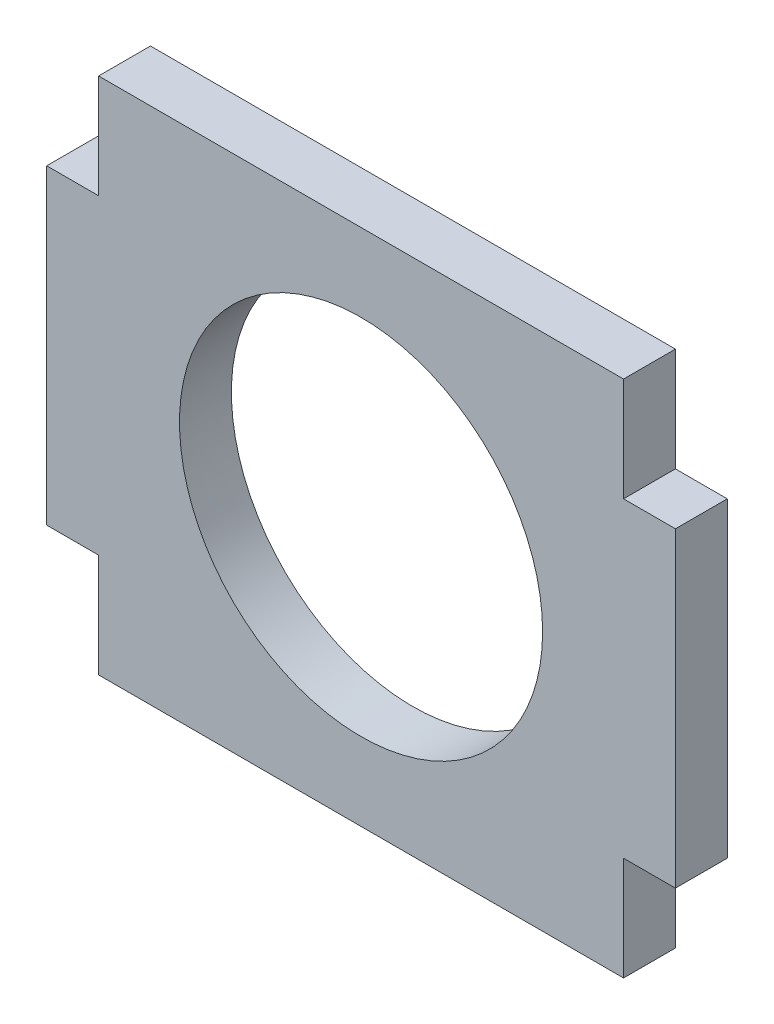
ISO-10303-21;
HEADER;
FILE_DESCRIPTION(('STEP AP214'),'2;1');
FILE_NAME('part.step','',(''),(''),'','','');
FILE_SCHEMA(('AUTOMOTIVE_DESIGN { 1 0 10303 214 1 1 1 1 }'));
ENDSEC;
DATA;
#1=APPLICATION_CONTEXT('core data for automotive mechanical design processes');
#2=APPLICATION_PROTOCOL_DEFINITION('international standard','automotive_design',2000,#1);
#3=PRODUCT_CONTEXT('',#1,'mechanical');
#4=PRODUCT('Part','Part','',(#3));
#5=PRODUCT_RELATED_PRODUCT_CATEGORY('part','',(#4));
#6=PRODUCT_DEFINITION_FORMATION('','',#4);
#7=PRODUCT_DEFINITION_CONTEXT('part definition',#1,'design');
#8=PRODUCT_DEFINITION('design','',#6,#7);
#9=PRODUCT_DEFINITION_SHAPE('','',#8);
#10=(LENGTH_UNIT() NAMED_UNIT(*) SI_UNIT(.MILLI.,.METRE.));
#11=(NAMED_UNIT(*) PLANE_ANGLE_UNIT() SI_UNIT($,.RADIAN.));
#12=(NAMED_UNIT(*) SI_UNIT($,.STERADIAN.) SOLID_ANGLE_UNIT());
#13=UNCERTAINTY_MEASURE_WITH_UNIT(LENGTH_MEASURE(1.E-05),#10,'distance_accuracy_value','');
#14=(GEOMETRIC_REPRESENTATION_CONTEXT(3) GLOBAL_UNCERTAINTY_ASSIGNED_CONTEXT((#13)) GLOBAL_UNIT_ASSIGNED_CONTEXT((#10,
#11,#12)) REPRESENTATION_CONTEXT('',''));
#15=CARTESIAN_POINT('',(0.,0.,0.));
#16=DIRECTION('',(0.,0.,1.));
#17=DIRECTION('',(1.,0.,0.));
#18=AXIS2_PLACEMENT_3D('',#15,#16,#17);
#19=CARTESIAN_POINT('',(0.,0.,3.175));
#20=DIRECTION('',(0.,0.,-1.));
#21=DIRECTION('',(-1.,0.,0.));
#22=AXIS2_PLACEMENT_3D('',#19,#20,#21);
#23=PLANE('',#22);
#24=DIRECTION('',(-1.,0.,0.));
#25=VECTOR('',#24,1.);
#26=CARTESIAN_POINT('',(-16.0655,9.525,3.175));
#27=LINE('',#26,#25);
#28=CARTESIAN_POINT('',(-16.0655,9.525,3.175));
#29=VERTEX_POINT('',#28);
#30=CARTESIAN_POINT('',(-19.2405,9.525,3.175));
#31=VERTEX_POINT('',#30);
#32=EDGE_CURVE('E182',#29,#31,#27,.T.);
#33=ORIENTED_EDGE('',*,*,#32,.T.);
#34=DIRECTION('',(0.,-1.,0.));
#35=VECTOR('',#34,1.);
#36=CARTESIAN_POINT('',(-19.2405,-9.525,3.175));
#37=LINE('',#36,#35);
#38=CARTESIAN_POINT('',(-19.2405,-9.525,3.175));
#39=VERTEX_POINT('',#38);
#40=EDGE_CURVE('E110',#31,#39,#37,.T.);
#41=ORIENTED_EDGE('',*,*,#40,.T.);
#42=DIRECTION('',(1.,0.,0.));
#43=VECTOR('',#42,1.);
#44=CARTESIAN_POINT('',(-19.2405,-9.525,3.175));
#45=LINE('',#44,#43);
#46=CARTESIAN_POINT('',(-16.0655,-9.525,3.175));
#47=VERTEX_POINT('',#46);
#48=EDGE_CURVE('E209',#39,#47,#45,.T.);
#49=ORIENTED_EDGE('',*,*,#48,.T.);
#50=DIRECTION('',(0.,-1.,0.));
#51=VECTOR('',#50,1.);
#52=CARTESIAN_POINT('',(-16.0655,-9.525,3.175));
#53=LINE('',#52,#51);
#54=CARTESIAN_POINT('',(-16.0655,-15.875,3.175));
#55=VERTEX_POINT('',#54);
#56=EDGE_CURVE('E228',#47,#55,#53,.T.);
#57=ORIENTED_EDGE('',*,*,#56,.T.);
#58=DIRECTION('',(1.,0.,0.));
#59=VECTOR('',#58,1.);
#60=CARTESIAN_POINT('',(-16.0655,-15.875,3.175));
#61=LINE('',#60,#59);
#62=CARTESIAN_POINT('',(16.0655,-15.875,3.175));
#63=VERTEX_POINT('',#62);
#64=EDGE_CURVE('E225',#55,#63,#61,.T.);
#65=ORIENTED_EDGE('',*,*,#64,.T.);
#66=DIRECTION('',(0.,1.,0.));
#67=VECTOR('',#66,1.);
#68=CARTESIAN_POINT('',(16.0655,-15.875,3.175));
#69=LINE('',#68,#67);
#70=CARTESIAN_POINT('',(16.0655,-9.525,3.175));
#71=VERTEX_POINT('',#70);
#72=EDGE_CURVE('E227',#63,#71,#69,.T.);
#73=ORIENTED_EDGE('',*,*,#72,.T.);
#74=DIRECTION('',(1.,0.,0.));
#75=VECTOR('',#74,1.);
#76=CARTESIAN_POINT('',(16.0655,-9.525,3.175));
#77=LINE('',#76,#75);
#78=CARTESIAN_POINT('',(19.2405,-9.525,3.175));
#79=VERTEX_POINT('',#78);
#80=EDGE_CURVE('E230',#71,#79,#77,.T.);
#81=ORIENTED_EDGE('',*,*,#80,.T.);
#82=DIRECTION('',(0.,1.,0.));
#83=VECTOR('',#82,1.);
#84=CARTESIAN_POINT('',(19.2405,-9.525,3.175));
#85=LINE('',#84,#83);
#86=CARTESIAN_POINT('',(19.2405,9.525,3.175));
#87=VERTEX_POINT('',#86);
#88=EDGE_CURVE('E236',#79,#87,#85,.T.);
#89=ORIENTED_EDGE('',*,*,#88,.T.);
#90=DIRECTION('',(-1.,0.,0.));
#91=VECTOR('',#90,1.);
#92=CARTESIAN_POINT('',(19.2405,9.525,3.175));
#93=LINE('',#92,#91);
#94=CARTESIAN_POINT('',(16.0655,9.525,3.175));
#95=VERTEX_POINT('',#94);
#96=EDGE_CURVE('E141',#87,#95,#93,.T.);
#97=ORIENTED_EDGE('',*,*,#96,.T.);
#98=DIRECTION('',(0.,1.,0.));
#99=VECTOR('',#98,1.);
#100=CARTESIAN_POINT('',(16.0655,9.525,3.175));
#101=LINE('',#100,#99);
#102=CARTESIAN_POINT('',(16.0655,15.875,3.175));
#103=VERTEX_POINT('',#102);
#104=EDGE_CURVE('E135',#95,#103,#101,.T.);
#105=ORIENTED_EDGE('',*,*,#104,.T.);
#106=DIRECTION('',(-1.,0.,0.));
#107=VECTOR('',#106,1.);
#108=CARTESIAN_POINT('',(16.0655,15.875,3.175));
#109=LINE('',#108,#107);
#110=CARTESIAN_POINT('',(-16.0655,15.875,3.175));
#111=VERTEX_POINT('',#110);
#112=EDGE_CURVE('E139',#103,#111,#109,.T.);
#113=ORIENTED_EDGE('',*,*,#112,.T.);
#114=DIRECTION('',(0.,-1.,0.));
#115=VECTOR('',#114,1.);
#116=CARTESIAN_POINT('',(-16.0655,15.875,3.175));
#117=LINE('',#116,#115);
#118=EDGE_CURVE('E55',#111,#29,#117,.T.);
#119=ORIENTED_EDGE('',*,*,#118,.T.);
#120=EDGE_LOOP('',(#33,#41,#49,#57,#65,#73,#81,#89,#97,#105,#113,#119));
#121=FACE_BOUND('',#120,.T.);
#122=CARTESIAN_POINT('',(0.,0.,3.175));
#123=DIRECTION('',(0.,0.,1.));
#124=DIRECTION('',(1.,0.,0.));
#125=AXIS2_PLACEMENT_3D('',#122,#123,#124);
#126=CIRCLE('',#125,11.1125);
#127=CARTESIAN_POINT('',(11.1125,0.,3.175));
#128=VERTEX_POINT('',#127);
#129=EDGE_CURVE('E163',#128,#128,#126,.T.);
#130=ORIENTED_EDGE('',*,*,#129,.F.);
#131=EDGE_LOOP('',(#130));
#132=FACE_BOUND('',#131,.T.);
#133=ADVANCED_FACE('F38',(#121,#132),#23,.F.);
#134=CARTESIAN_POINT('',(0.,0.,0.));
#135=DIRECTION('',(0.,0.,-1.));
#136=DIRECTION('',(-1.,0.,0.));
#137=AXIS2_PLACEMENT_3D('',#134,#135,#136);
#138=PLANE('',#137);
#139=DIRECTION('',(-1.,0.,0.));
#140=VECTOR('',#139,1.);
#141=CARTESIAN_POINT('',(-16.0655,9.525,0.));
#142=LINE('',#141,#140);
#143=CARTESIAN_POINT('',(-16.0655,9.525,0.));
#144=VERTEX_POINT('',#143);
#145=CARTESIAN_POINT('',(-19.2405,9.525,0.));
#146=VERTEX_POINT('',#145);
#147=EDGE_CURVE('E159',#144,#146,#142,.T.);
#148=ORIENTED_EDGE('',*,*,#147,.F.);
#149=DIRECTION('',(0.,-1.,0.));
#150=VECTOR('',#149,1.);
#151=CARTESIAN_POINT('',(-16.0655,15.875,0.));
#152=LINE('',#151,#150);
#153=CARTESIAN_POINT('',(-16.0655,15.875,0.));
#154=VERTEX_POINT('',#153);
#155=EDGE_CURVE('E102',#154,#144,#152,.T.);
#156=ORIENTED_EDGE('',*,*,#155,.F.);
#157=DIRECTION('',(-1.,0.,0.));
#158=VECTOR('',#157,1.);
#159=CARTESIAN_POINT('',(16.0655,15.875,0.));
#160=LINE('',#159,#158);
#161=CARTESIAN_POINT('',(16.0655,15.875,0.));
#162=VERTEX_POINT('',#161);
#163=EDGE_CURVE('E96',#162,#154,#160,.T.);
#164=ORIENTED_EDGE('',*,*,#163,.F.);
#165=DIRECTION('',(0.,1.,0.));
#166=VECTOR('',#165,1.);
#167=CARTESIAN_POINT('',(16.0655,9.525,0.));
#168=LINE('',#167,#166);
#169=CARTESIAN_POINT('',(16.0655,9.525,0.));
#170=VERTEX_POINT('',#169);
#171=EDGE_CURVE('E149',#170,#162,#168,.T.);
#172=ORIENTED_EDGE('',*,*,#171,.F.);
#173=DIRECTION('',(-1.,0.,0.));
#174=VECTOR('',#173,1.);
#175=CARTESIAN_POINT('',(19.2405,9.525,0.));
#176=LINE('',#175,#174);
#177=CARTESIAN_POINT('',(19.2405,9.525,0.));
#178=VERTEX_POINT('',#177);
#179=EDGE_CURVE('E177',#178,#170,#176,.T.);
#180=ORIENTED_EDGE('',*,*,#179,.F.);
#181=DIRECTION('',(0.,1.,0.));
#182=VECTOR('',#181,1.);
#183=CARTESIAN_POINT('',(19.2405,-9.525,0.));
#184=LINE('',#183,#182);
#185=CARTESIAN_POINT('',(19.2405,-9.525,0.));
#186=VERTEX_POINT('',#185);
#187=EDGE_CURVE('E175',#186,#178,#184,.T.);
#188=ORIENTED_EDGE('',*,*,#187,.F.);
#189=DIRECTION('',(1.,0.,0.));
#190=VECTOR('',#189,1.);
#191=CARTESIAN_POINT('',(16.0655,-9.525,0.));
#192=LINE('',#191,#190);
#193=CARTESIAN_POINT('',(16.0655,-9.525,0.));
#194=VERTEX_POINT('',#193);
#195=EDGE_CURVE('E173',#194,#186,#192,.T.);
#196=ORIENTED_EDGE('',*,*,#195,.F.);
#197=DIRECTION('',(0.,1.,0.));
#198=VECTOR('',#197,1.);
#199=CARTESIAN_POINT('',(16.0655,-15.875,0.));
#200=LINE('',#199,#198);
#201=CARTESIAN_POINT('',(16.0655,-15.875,0.));
#202=VERTEX_POINT('',#201);
#203=EDGE_CURVE('E171',#202,#194,#200,.T.);
#204=ORIENTED_EDGE('',*,*,#203,.F.);
#205=DIRECTION('',(1.,0.,0.));
#206=VECTOR('',#205,1.);
#207=CARTESIAN_POINT('',(-16.0655,-15.875,0.));
#208=LINE('',#207,#206);
#209=CARTESIAN_POINT('',(-16.0655,-15.875,0.));
#210=VERTEX_POINT('',#209);
#211=EDGE_CURVE('E169',#210,#202,#208,.T.);
#212=ORIENTED_EDGE('',*,*,#211,.F.);
#213=DIRECTION('',(0.,-1.,0.));
#214=VECTOR('',#213,1.);
#215=CARTESIAN_POINT('',(-16.0655,-9.525,0.));
#216=LINE('',#215,#214);
#217=CARTESIAN_POINT('',(-16.0655,-9.525,0.));
#218=VERTEX_POINT('',#217);
#219=EDGE_CURVE('E167',#218,#210,#216,.T.);
#220=ORIENTED_EDGE('',*,*,#219,.F.);
#221=DIRECTION('',(1.,0.,0.));
#222=VECTOR('',#221,1.);
#223=CARTESIAN_POINT('',(-19.2405,-9.525,0.));
#224=LINE('',#223,#222);
#225=CARTESIAN_POINT('',(-19.2405,-9.525,0.));
#226=VERTEX_POINT('',#225);
#227=EDGE_CURVE('E165',#226,#218,#224,.T.);
#228=ORIENTED_EDGE('',*,*,#227,.F.);
#229=DIRECTION('',(0.,-1.,0.));
#230=VECTOR('',#229,1.);
#231=CARTESIAN_POINT('',(-19.2405,-9.525,0.));
#232=LINE('',#231,#230);
#233=EDGE_CURVE('E162',#146,#226,#232,.T.);
#234=ORIENTED_EDGE('',*,*,#233,.F.);
#235=EDGE_LOOP('',(#148,#156,#164,#172,#180,#188,#196,#204,#212,#220,#228,#234));
#236=FACE_BOUND('',#235,.T.);
#237=CARTESIAN_POINT('',(0.,0.,0.));
#238=DIRECTION('',(0.,0.,1.));
#239=DIRECTION('',(1.,0.,0.));
#240=AXIS2_PLACEMENT_3D('',#237,#238,#239);
#241=CIRCLE('',#240,11.1125);
#242=CARTESIAN_POINT('',(11.1125,0.,0.));
#243=VERTEX_POINT('',#242);
#244=EDGE_CURVE('E383',#243,#243,#241,.T.);
#245=ORIENTED_EDGE('',*,*,#244,.T.);
#246=EDGE_LOOP('',(#245));
#247=FACE_BOUND('',#246,.T.);
#248=ADVANCED_FACE('F213',(#236,#247),#138,.T.);
#249=CARTESIAN_POINT('',(-16.0655,9.525,3.175));
#250=DIRECTION('',(0.,-1.,0.));
#251=DIRECTION('',(0.,0.,-1.));
#252=AXIS2_PLACEMENT_3D('',#249,#250,#251);
#253=PLANE('',#252);
#254=ORIENTED_EDGE('',*,*,#147,.T.);
#255=DIRECTION('',(0.,0.,-1.));
#256=VECTOR('',#255,1.);
#257=CARTESIAN_POINT('',(-19.2405,9.525,3.175));
#258=LINE('',#257,#256);
#259=EDGE_CURVE('E11',#31,#146,#258,.T.);
#260=ORIENTED_EDGE('',*,*,#259,.F.);
#261=ORIENTED_EDGE('',*,*,#32,.F.);
#262=DIRECTION('',(0.,0.,-1.));
#263=VECTOR('',#262,1.);
#264=CARTESIAN_POINT('',(-16.0655,9.525,3.175));
#265=LINE('',#264,#263);
#266=EDGE_CURVE('E155',#29,#144,#265,.T.);
#267=ORIENTED_EDGE('',*,*,#266,.T.);
#268=EDGE_LOOP('',(#254,#260,#261,#267));
#269=FACE_BOUND('',#268,.T.);
#270=ADVANCED_FACE('F40',(#269),#253,.F.);
#271=CARTESIAN_POINT('',(-19.2405,-9.525,3.175));
#272=DIRECTION('',(1.,0.,0.));
#273=DIRECTION('',(0.,0.,-1.));
#274=AXIS2_PLACEMENT_3D('',#271,#272,#273);
#275=PLANE('',#274);
#276=ORIENTED_EDGE('',*,*,#233,.T.);
#277=DIRECTION('',(0.,0.,-1.));
#278=VECTOR('',#277,1.);
#279=CARTESIAN_POINT('',(-19.2405,-9.525,3.175));
#280=LINE('',#279,#278);
#281=EDGE_CURVE('E47',#39,#226,#280,.T.);
#282=ORIENTED_EDGE('',*,*,#281,.F.);
#283=ORIENTED_EDGE('',*,*,#40,.F.);
#284=ORIENTED_EDGE('',*,*,#259,.T.);
#285=EDGE_LOOP('',(#276,#282,#283,#284));
#286=FACE_BOUND('',#285,.T.);
#287=ADVANCED_FACE('F270',(#286),#275,.F.);
#288=CARTESIAN_POINT('',(-19.2405,-9.525,3.175));
#289=DIRECTION('',(0.,1.,0.));
#290=DIRECTION('',(0.,0.,1.));
#291=AXIS2_PLACEMENT_3D('',#288,#289,#290);
#292=PLANE('',#291);
#293=ORIENTED_EDGE('',*,*,#227,.T.);
#294=DIRECTION('',(0.,0.,-1.));
#295=VECTOR('',#294,1.);
#296=CARTESIAN_POINT('',(-16.0655,-9.525,3.175));
#297=LINE('',#296,#295);
#298=EDGE_CURVE('E201',#47,#218,#297,.T.);
#299=ORIENTED_EDGE('',*,*,#298,.F.);
#300=ORIENTED_EDGE('',*,*,#48,.F.);
#301=ORIENTED_EDGE('',*,*,#281,.T.);
#302=EDGE_LOOP('',(#293,#299,#300,#301));
#303=FACE_BOUND('',#302,.T.);
#304=ADVANCED_FACE('F207',(#303),#292,.F.);
#305=CARTESIAN_POINT('',(-16.0655,-9.525,3.175));
#306=DIRECTION('',(1.,0.,0.));
#307=DIRECTION('',(0.,0.,-1.));
#308=AXIS2_PLACEMENT_3D('',#305,#306,#307);
#309=PLANE('',#308);
#310=ORIENTED_EDGE('',*,*,#219,.T.);
#311=DIRECTION('',(0.,0.,-1.));
#312=VECTOR('',#311,1.);
#313=CARTESIAN_POINT('',(-16.0655,-15.875,3.175));
#314=LINE('',#313,#312);
#315=EDGE_CURVE('E198',#55,#210,#314,.T.);
#316=ORIENTED_EDGE('',*,*,#315,.F.);
#317=ORIENTED_EDGE('',*,*,#56,.F.);
#318=ORIENTED_EDGE('',*,*,#298,.T.);
#319=EDGE_LOOP('',(#310,#316,#317,#318));
#320=FACE_BOUND('',#319,.T.);
#321=ADVANCED_FACE('F219',(#320),#309,.F.);
#322=CARTESIAN_POINT('',(-16.0655,-15.875,3.175));
#323=DIRECTION('',(0.,1.,0.));
#324=DIRECTION('',(-1.,0.,0.));
#325=AXIS2_PLACEMENT_3D('',#322,#323,#324);
#326=PLANE('',#325);
#327=ORIENTED_EDGE('',*,*,#211,.T.);
#328=DIRECTION('',(0.,0.,-1.));
#329=VECTOR('',#328,1.);
#330=CARTESIAN_POINT('',(16.0655,-15.875,3.175));
#331=LINE('',#330,#329);
#332=EDGE_CURVE('E195',#63,#202,#331,.T.);
#333=ORIENTED_EDGE('',*,*,#332,.F.);
#334=ORIENTED_EDGE('',*,*,#64,.F.);
#335=ORIENTED_EDGE('',*,*,#315,.T.);
#336=EDGE_LOOP('',(#327,#333,#334,#335));
#337=FACE_BOUND('',#336,.T.);
#338=ADVANCED_FACE('F223',(#337),#326,.F.);
#339=CARTESIAN_POINT('',(16.0655,-15.875,3.175));
#340=DIRECTION('',(-1.,0.,0.));
#341=DIRECTION('',(0.,-1.,0.));
#342=AXIS2_PLACEMENT_3D('',#339,#340,#341);
#343=PLANE('',#342);
#344=ORIENTED_EDGE('',*,*,#203,.T.);
#345=DIRECTION('',(0.,0.,-1.));
#346=VECTOR('',#345,1.);
#347=CARTESIAN_POINT('',(16.0655,-9.525,3.175));
#348=LINE('',#347,#346);
#349=EDGE_CURVE('E192',#71,#194,#348,.T.);
#350=ORIENTED_EDGE('',*,*,#349,.F.);
#351=ORIENTED_EDGE('',*,*,#72,.F.);
#352=ORIENTED_EDGE('',*,*,#332,.T.);
#353=EDGE_LOOP('',(#344,#350,#351,#352));
#354=FACE_BOUND('',#353,.T.);
#355=ADVANCED_FACE('F283',(#354),#343,.F.);
#356=CARTESIAN_POINT('',(16.0655,-9.525,3.175));
#357=DIRECTION('',(0.,1.,0.));
#358=DIRECTION('',(-1.,0.,0.));
#359=AXIS2_PLACEMENT_3D('',#356,#357,#358);
#360=PLANE('',#359);
#361=ORIENTED_EDGE('',*,*,#195,.T.);
#362=DIRECTION('',(0.,0.,-1.));
#363=VECTOR('',#362,1.);
#364=CARTESIAN_POINT('',(19.2405,-9.525,3.175));
#365=LINE('',#364,#363);
#366=EDGE_CURVE('E189',#79,#186,#365,.T.);
#367=ORIENTED_EDGE('',*,*,#366,.F.);
#368=ORIENTED_EDGE('',*,*,#80,.F.);
#369=ORIENTED_EDGE('',*,*,#349,.T.);
#370=EDGE_LOOP('',(#361,#367,#368,#369));
#371=FACE_BOUND('',#370,.T.);
#372=ADVANCED_FACE('F286',(#371),#360,.F.);
#373=CARTESIAN_POINT('',(19.2405,-9.525,3.175));
#374=DIRECTION('',(-1.,0.,0.));
#375=DIRECTION('',(0.,0.,1.));
#376=AXIS2_PLACEMENT_3D('',#373,#374,#375);
#377=PLANE('',#376);
#378=ORIENTED_EDGE('',*,*,#187,.T.);
#379=DIRECTION('',(0.,0.,-1.));
#380=VECTOR('',#379,1.);
#381=CARTESIAN_POINT('',(19.2405,9.525,3.175));
#382=LINE('',#381,#380);
#383=EDGE_CURVE('E186',#87,#178,#382,.T.);
#384=ORIENTED_EDGE('',*,*,#383,.F.);
#385=ORIENTED_EDGE('',*,*,#88,.F.);
#386=ORIENTED_EDGE('',*,*,#366,.T.);
#387=EDGE_LOOP('',(#378,#384,#385,#386));
#388=FACE_BOUND('',#387,.T.);
#389=ADVANCED_FACE('F242',(#388),#377,.F.);
#390=CARTESIAN_POINT('',(19.2405,9.525,3.175));
#391=DIRECTION('',(0.,-1.,0.));
#392=DIRECTION('',(0.,0.,-1.));
#393=AXIS2_PLACEMENT_3D('',#390,#391,#392);
#394=PLANE('',#393);
#395=ORIENTED_EDGE('',*,*,#179,.T.);
#396=DIRECTION('',(0.,0.,-1.));
#397=VECTOR('',#396,1.);
#398=CARTESIAN_POINT('',(16.0655,9.525,3.175));
#399=LINE('',#398,#397);
#400=EDGE_CURVE('E150',#95,#170,#399,.T.);
#401=ORIENTED_EDGE('',*,*,#400,.F.);
#402=ORIENTED_EDGE('',*,*,#96,.F.);
#403=ORIENTED_EDGE('',*,*,#383,.T.);
#404=EDGE_LOOP('',(#395,#401,#402,#403));
#405=FACE_BOUND('',#404,.T.);
#406=ADVANCED_FACE('F246',(#405),#394,.F.);
#407=CARTESIAN_POINT('',(16.0655,9.525,3.175));
#408=DIRECTION('',(-1.,0.,0.));
#409=DIRECTION('',(0.,0.,1.));
#410=AXIS2_PLACEMENT_3D('',#407,#408,#409);
#411=PLANE('',#410);
#412=ORIENTED_EDGE('',*,*,#171,.T.);
#413=DIRECTION('',(0.,0.,-1.));
#414=VECTOR('',#413,1.);
#415=CARTESIAN_POINT('',(16.0655,15.875,3.175));
#416=LINE('',#415,#414);
#417=EDGE_CURVE('E146',#103,#162,#416,.T.);
#418=ORIENTED_EDGE('',*,*,#417,.F.);
#419=ORIENTED_EDGE('',*,*,#104,.F.);
#420=ORIENTED_EDGE('',*,*,#400,.T.);
#421=EDGE_LOOP('',(#412,#418,#419,#420));
#422=FACE_BOUND('',#421,.T.);
#423=ADVANCED_FACE('F147',(#422),#411,.F.);
#424=CARTESIAN_POINT('',(16.0655,15.875,3.175));
#425=DIRECTION('',(0.,-1.,0.));
#426=DIRECTION('',(0.,0.,-1.));
#427=AXIS2_PLACEMENT_3D('',#424,#425,#426);
#428=PLANE('',#427);
#429=ORIENTED_EDGE('',*,*,#163,.T.);
#430=DIRECTION('',(0.,0.,-1.));
#431=VECTOR('',#430,1.);
#432=CARTESIAN_POINT('',(-16.0655,15.875,3.175));
#433=LINE('',#432,#431);
#434=EDGE_CURVE('E151',#111,#154,#433,.T.);
#435=ORIENTED_EDGE('',*,*,#434,.F.);
#436=ORIENTED_EDGE('',*,*,#112,.F.);
#437=ORIENTED_EDGE('',*,*,#417,.T.);
#438=EDGE_LOOP('',(#429,#435,#436,#437));
#439=FACE_BOUND('',#438,.T.);
#440=ADVANCED_FACE('F153',(#439),#428,.F.);
#441=CARTESIAN_POINT('',(-16.0655,15.875,3.175));
#442=DIRECTION('',(1.,0.,0.));
#443=DIRECTION('',(0.,0.,-1.));
#444=AXIS2_PLACEMENT_3D('',#441,#442,#443);
#445=PLANE('',#444);
#446=ORIENTED_EDGE('',*,*,#155,.T.);
#447=ORIENTED_EDGE('',*,*,#266,.F.);
#448=ORIENTED_EDGE('',*,*,#118,.F.);
#449=ORIENTED_EDGE('',*,*,#434,.T.);
#450=EDGE_LOOP('',(#446,#447,#448,#449));
#451=FACE_BOUND('',#450,.T.);
#452=ADVANCED_FACE('F250',(#451),#445,.F.);
#453=CARTESIAN_POINT('',(0.,0.,3.175));
#454=DIRECTION('',(0.,0.,-1.));
#455=DIRECTION('',(-1.,0.,0.));
#456=AXIS2_PLACEMENT_3D('',#453,#454,#455);
#457=CYLINDRICAL_SURFACE('',#456,11.1125);
#458=ORIENTED_EDGE('',*,*,#129,.T.);
#459=EDGE_LOOP('',(#458));
#460=FACE_BOUND('',#459,.T.);
#461=ORIENTED_EDGE('',*,*,#244,.F.);
#462=EDGE_LOOP('',(#461));
#463=FACE_BOUND('',#462,.T.);
#464=ADVANCED_FACE('F252',(#460,#463),#457,.F.);
#465=CLOSED_SHELL('',(#133,#248,#270,#287,#304,#321,#338,#355,#372,#389,#406,#423,#440,#452,#464));
#466=MANIFOLD_SOLID_BREP('B2',#465);
#467=ADVANCED_BREP_SHAPE_REPRESENTATION('',(#18,#466),#14);
#468=SHAPE_DEFINITION_REPRESENTATION(#9,#467);
ENDSEC;
END-ISO-10303-21;
